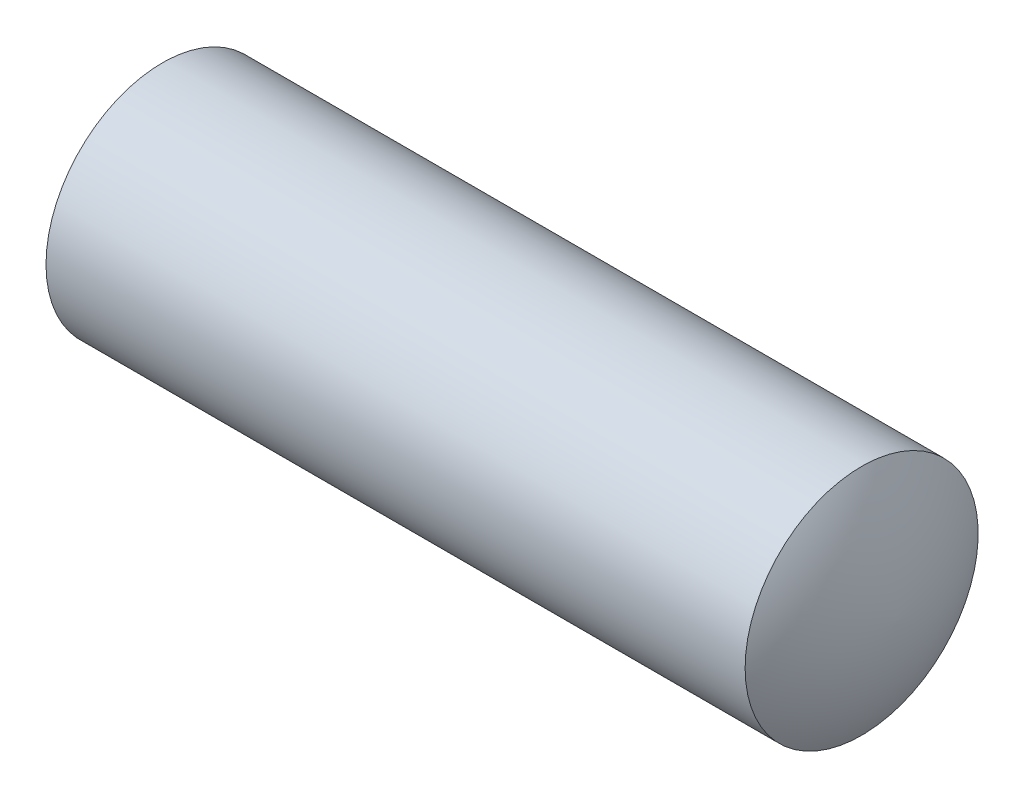
ISO-10303-21;
HEADER;
FILE_DESCRIPTION(('STEP AP214'),'2;1');
FILE_NAME('part.step','',(''),(''),'','','');
FILE_SCHEMA(('AUTOMOTIVE_DESIGN { 1 0 10303 214 1 1 1 1 }'));
ENDSEC;
DATA;
#1=APPLICATION_CONTEXT('core data for automotive mechanical design processes');
#2=APPLICATION_PROTOCOL_DEFINITION('international standard','automotive_design',2000,#1);
#3=PRODUCT_CONTEXT('',#1,'mechanical');
#4=PRODUCT('Part','Part','',(#3));
#5=PRODUCT_RELATED_PRODUCT_CATEGORY('part','',(#4));
#6=PRODUCT_DEFINITION_FORMATION('','',#4);
#7=PRODUCT_DEFINITION_CONTEXT('part definition',#1,'design');
#8=PRODUCT_DEFINITION('design','',#6,#7);
#9=PRODUCT_DEFINITION_SHAPE('','',#8);
#10=(LENGTH_UNIT() NAMED_UNIT(*) SI_UNIT(.MILLI.,.METRE.));
#11=(NAMED_UNIT(*) PLANE_ANGLE_UNIT() SI_UNIT($,.RADIAN.));
#12=(NAMED_UNIT(*) SI_UNIT($,.STERADIAN.) SOLID_ANGLE_UNIT());
#13=UNCERTAINTY_MEASURE_WITH_UNIT(LENGTH_MEASURE(1.E-05),#10,'distance_accuracy_value','');
#14=(GEOMETRIC_REPRESENTATION_CONTEXT(3) GLOBAL_UNCERTAINTY_ASSIGNED_CONTEXT((#13)) GLOBAL_UNIT_ASSIGNED_CONTEXT((#10,
#11,#12)) REPRESENTATION_CONTEXT('',''));
#15=CARTESIAN_POINT('',(0.,0.,0.));
#16=DIRECTION('',(0.,0.,1.));
#17=DIRECTION('',(1.,0.,0.));
#18=AXIS2_PLACEMENT_3D('',#15,#16,#17);
#19=CARTESIAN_POINT('',(3.39849957179514,0.,-0.109549871538541));
#20=DIRECTION('',(0.,-1.,0.));
#21=DIRECTION('',(0.,0.,1.));
#22=AXIS2_PLACEMENT_3D('',#19,#20,#21);
#23=CIRCLE('',#22,4.);
#24=TRIMMED_CURVE('',#23,(PARAMETER_VALUE(-1.5434054339856)),(PARAMETER_VALUE(1.5434054339856)),
.T.,.PARAMETER.);
#25=CARTESIAN_POINT('',(3.39849957179514,0.,0.));
#26=DIRECTION('',(-1.,0.,0.));
#27=AXIS1_PLACEMENT('',#25,#26);
#28=SURFACE_OF_REVOLUTION('',#24,#27);
#29=CARTESIAN_POINT('',(-0.6,0.,0.));
#30=VERTEX_POINT('',#29);
#31=VERTEX_LOOP('',#30);
#32=FACE_BOUND('',#31,.T.);
#33=CARTESIAN_POINT('',(0.,0.,0.));
#34=DIRECTION('',(-1.,0.,0.));
#35=DIRECTION('',(0.,0.,1.));
#36=AXIS2_PLACEMENT_3D('',#33,#34,#35);
#37=CIRCLE('',#36,2.);
#38=CARTESIAN_POINT('',(0.,0.,2.));
#39=VERTEX_POINT('',#38);
#40=EDGE_CURVE('E44',#39,#39,#37,.T.);
#41=ORIENTED_EDGE('',*,*,#40,.T.);
#42=EDGE_LOOP('',(#41));
#43=FACE_BOUND('',#42,.T.);
#44=ADVANCED_FACE('F37',(#32,#43),#28,.T.);
#45=CARTESIAN_POINT('',(8.60150042820487,0.,-0.109549871538546));
#46=DIRECTION('',(0.,-1.,0.));
#47=DIRECTION('',(0.,0.,1.));
#48=AXIS2_PLACEMENT_3D('',#45,#46,#47);
#49=CIRCLE('',#48,4.);
#50=TRIMMED_CURVE('',#49,(PARAMETER_VALUE(-1.5434054339856)),(PARAMETER_VALUE(1.5434054339856)),
.T.,.PARAMETER.);
#51=CARTESIAN_POINT('',(8.60150042820487,0.,0.));
#52=DIRECTION('',(-1.,0.,0.));
#53=AXIS1_PLACEMENT('',#51,#52);
#54=SURFACE_OF_REVOLUTION('',#50,#53);
#55=CARTESIAN_POINT('',(12.,0.,0.));
#56=DIRECTION('',(-1.,0.,0.));
#57=DIRECTION('',(0.,0.,1.));
#58=AXIS2_PLACEMENT_3D('',#55,#56,#57);
#59=CIRCLE('',#58,2.);
#60=CARTESIAN_POINT('',(12.,0.,2.));
#61=VERTEX_POINT('',#60);
#62=EDGE_CURVE('E11',#61,#61,#59,.T.);
#63=ORIENTED_EDGE('',*,*,#62,.F.);
#64=EDGE_LOOP('',(#63));
#65=FACE_BOUND('',#64,.T.);
#66=CARTESIAN_POINT('',(12.6,0.,0.));
#67=VERTEX_POINT('',#66);
#68=VERTEX_LOOP('',#67);
#69=FACE_BOUND('',#68,.T.);
#70=ADVANCED_FACE('F52',(#65,#69),#54,.T.);
#71=CARTESIAN_POINT('',(0.,0.,0.));
#72=DIRECTION('',(-1.,0.,0.));
#73=DIRECTION('',(0.,0.,1.));
#74=AXIS2_PLACEMENT_3D('',#71,#72,#73);
#75=CYLINDRICAL_SURFACE('',#74,2.);
#76=ORIENTED_EDGE('',*,*,#40,.F.);
#77=EDGE_LOOP('',(#76));
#78=FACE_BOUND('',#77,.T.);
#79=ORIENTED_EDGE('',*,*,#62,.T.);
#80=EDGE_LOOP('',(#79));
#81=FACE_BOUND('',#80,.T.);
#82=ADVANCED_FACE('F56',(#78,#81),#75,.T.);
#83=CLOSED_SHELL('',(#44,#70,#82));
#84=MANIFOLD_SOLID_BREP('B2',#83);
#85=ADVANCED_BREP_SHAPE_REPRESENTATION('',(#18,#84),#14);
#86=SHAPE_DEFINITION_REPRESENTATION(#9,#85);
ENDSEC;
END-ISO-10303-21;
